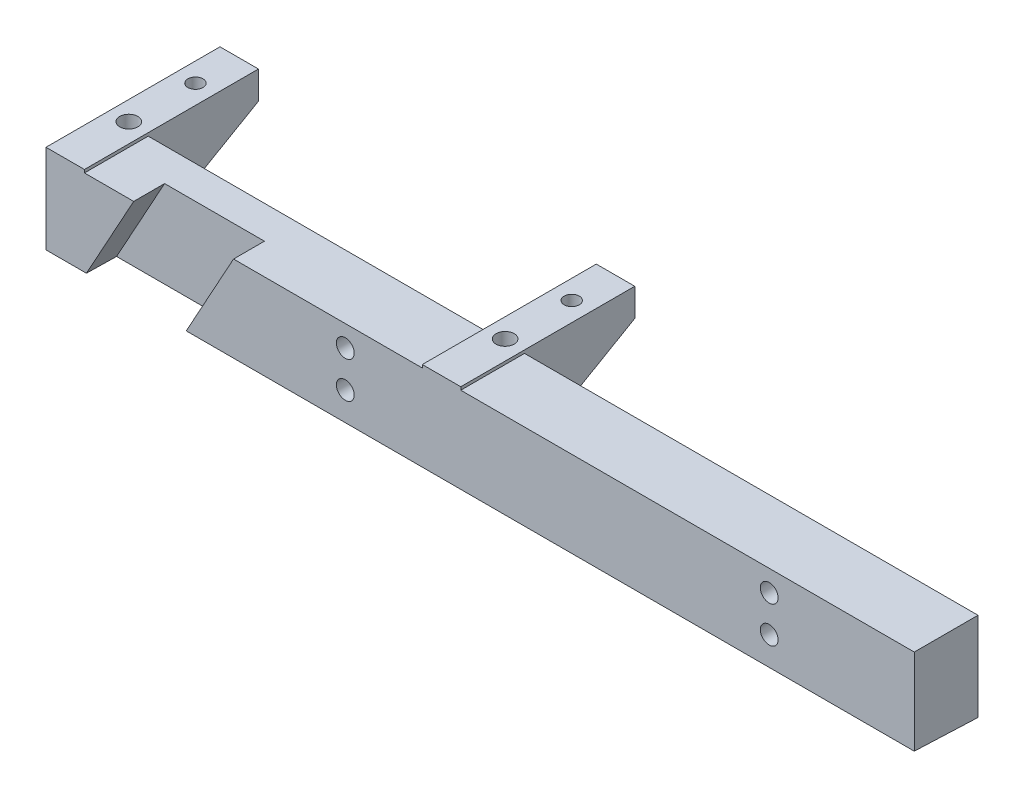
ISO-10303-21;
HEADER;
FILE_DESCRIPTION(('STEP AP214'),'2;1');
FILE_NAME('part.step','',(''),(''),'','','');
FILE_SCHEMA(('AUTOMOTIVE_DESIGN { 1 0 10303 214 1 1 1 1 }'));
ENDSEC;
DATA;
#1=APPLICATION_CONTEXT('core data for automotive mechanical design processes');
#2=APPLICATION_PROTOCOL_DEFINITION('international standard','automotive_design',2000,#1);
#3=PRODUCT_CONTEXT('',#1,'mechanical');
#4=PRODUCT('Part','Part','',(#3));
#5=PRODUCT_RELATED_PRODUCT_CATEGORY('part','',(#4));
#6=PRODUCT_DEFINITION_FORMATION('','',#4);
#7=PRODUCT_DEFINITION_CONTEXT('part definition',#1,'design');
#8=PRODUCT_DEFINITION('design','',#6,#7);
#9=PRODUCT_DEFINITION_SHAPE('','',#8);
#10=(LENGTH_UNIT() NAMED_UNIT(*) SI_UNIT(.MILLI.,.METRE.));
#11=(NAMED_UNIT(*) PLANE_ANGLE_UNIT() SI_UNIT($,.RADIAN.));
#12=(NAMED_UNIT(*) SI_UNIT($,.STERADIAN.) SOLID_ANGLE_UNIT());
#13=UNCERTAINTY_MEASURE_WITH_UNIT(LENGTH_MEASURE(1.E-05),#10,'distance_accuracy_value','');
#14=(GEOMETRIC_REPRESENTATION_CONTEXT(3) GLOBAL_UNCERTAINTY_ASSIGNED_CONTEXT((#13)) GLOBAL_UNIT_ASSIGNED_CONTEXT((#10,
#11,#12)) REPRESENTATION_CONTEXT('',''));
#15=CARTESIAN_POINT('',(0.,0.,0.));
#16=DIRECTION('',(0.,0.,1.));
#17=DIRECTION('',(1.,0.,0.));
#18=AXIS2_PLACEMENT_3D('',#15,#16,#17);
#19=CARTESIAN_POINT('',(143.3725,0.,0.));
#20=DIRECTION('',(0.,0.,-1.));
#21=DIRECTION('',(0.,1.,0.));
#22=AXIS2_PLACEMENT_3D('',#19,#20,#21);
#23=PLANE('',#22);
#24=DIRECTION('',(-1.,0.,0.));
#25=VECTOR('',#24,1.);
#26=CARTESIAN_POINT('',(143.3725,-14.18,0.));
#27=LINE('',#26,#25);
#28=CARTESIAN_POINT('',(6.67458264272988,-14.18,0.));
#29=VERTEX_POINT('',#28);
#30=CARTESIAN_POINT('',(0.,-14.18,0.));
#31=VERTEX_POINT('',#30);
#32=EDGE_CURVE('E310',#29,#31,#27,.T.);
#33=ORIENTED_EDGE('',*,*,#32,.F.);
#34=DIRECTION('',(-0.482365334124533,-0.875970139008704,0.));
#35=VECTOR('',#34,1.);
#36=CARTESIAN_POINT('',(14.483,0.,0.));
#37=LINE('',#36,#35);
#38=CARTESIAN_POINT('',(14.483,0.,0.));
#39=VERTEX_POINT('',#38);
#40=EDGE_CURVE('E191',#39,#29,#37,.T.);
#41=ORIENTED_EDGE('',*,*,#40,.F.);
#42=DIRECTION('',(-1.,0.,0.));
#43=VECTOR('',#42,1.);
#44=CARTESIAN_POINT('',(143.3725,0.,0.));
#45=LINE('',#44,#43);
#46=CARTESIAN_POINT('',(6.35000000000005,0.,0.));
#47=VERTEX_POINT('',#46);
#48=EDGE_CURVE('E317',#39,#47,#45,.T.);
#49=ORIENTED_EDGE('',*,*,#48,.T.);
#50=DIRECTION('',(0.,1.,0.));
#51=VECTOR('',#50,1.);
#52=CARTESIAN_POINT('',(6.35,0.5,0.));
#53=LINE('',#52,#51);
#54=CARTESIAN_POINT('',(6.35,0.5,0.));
#55=VERTEX_POINT('',#54);
#56=EDGE_CURVE('E271',#47,#55,#53,.T.);
#57=ORIENTED_EDGE('',*,*,#56,.T.);
#58=DIRECTION('',(-1.,0.,0.));
#59=VECTOR('',#58,1.);
#60=CARTESIAN_POINT('',(6.35,0.5,0.));
#61=LINE('',#60,#59);
#62=CARTESIAN_POINT('',(0.,0.5,0.));
#63=VERTEX_POINT('',#62);
#64=EDGE_CURVE('E287',#55,#63,#61,.T.);
#65=ORIENTED_EDGE('',*,*,#64,.T.);
#66=DIRECTION('',(0.,-1.,0.));
#67=VECTOR('',#66,1.);
#68=CARTESIAN_POINT('',(0.,0.,0.));
#69=LINE('',#68,#67);
#70=EDGE_CURVE('E304',#63,#31,#69,.T.);
#71=ORIENTED_EDGE('',*,*,#70,.T.);
#72=EDGE_LOOP('',(#33,#41,#49,#57,#65,#71));
#73=FACE_BOUND('',#72,.T.);
#74=ADVANCED_FACE('F33',(#73),#23,.F.);
#75=CARTESIAN_POINT('',(143.3725,0.,-10.525));
#76=DIRECTION('',(0.,0.,1.));
#77=DIRECTION('',(0.,-1.,0.));
#78=AXIS2_PLACEMENT_3D('',#75,#76,#77);
#79=PLANE('',#78);
#80=CARTESIAN_POINT('',(119.4195,-3.5,-10.525));
#81=DIRECTION('',(0.,0.,-1.));
#82=DIRECTION('',(0.,1.,0.));
#83=AXIS2_PLACEMENT_3D('',#80,#81,#82);
#84=CIRCLE('',#83,1.47319999999998);
#85=CARTESIAN_POINT('',(119.4195,-2.02680000000002,-10.525));
#86=VERTEX_POINT('',#85);
#87=EDGE_CURVE('E524',#86,#86,#84,.T.);
#88=ORIENTED_EDGE('',*,*,#87,.F.);
#89=EDGE_LOOP('',(#88));
#90=FACE_BOUND('',#89,.T.);
#91=CARTESIAN_POINT('',(119.4195,-9.5,-10.525));
#92=DIRECTION('',(0.,0.,-1.));
#93=DIRECTION('',(0.,1.,0.));
#94=AXIS2_PLACEMENT_3D('',#91,#92,#93);
#95=CIRCLE('',#94,1.47319999999998);
#96=CARTESIAN_POINT('',(119.4195,-8.02680000000002,-10.525));
#97=VERTEX_POINT('',#96);
#98=EDGE_CURVE('E526',#97,#97,#95,.T.);
#99=ORIENTED_EDGE('',*,*,#98,.F.);
#100=EDGE_LOOP('',(#99));
#101=FACE_BOUND('',#100,.T.);
#102=DIRECTION('',(0.,1.,0.));
#103=VECTOR('',#102,1.);
#104=CARTESIAN_POINT('',(68.4872,-14.62,-10.525));
#105=LINE('',#104,#103);
#106=CARTESIAN_POINT('',(68.4872,-14.62,-10.525));
#107=VERTEX_POINT('',#106);
#108=CARTESIAN_POINT('',(68.4872,0.,-10.525));
#109=VERTEX_POINT('',#108);
#110=EDGE_CURVE('E239',#107,#109,#105,.T.);
#111=ORIENTED_EDGE('',*,*,#110,.T.);
#112=DIRECTION('',(-1.,0.,0.));
#113=VECTOR('',#112,1.);
#114=CARTESIAN_POINT('',(143.3725,0.,-10.525));
#115=LINE('',#114,#113);
#116=CARTESIAN_POINT('',(143.3725,0.,-10.525));
#117=VERTEX_POINT('',#116);
#118=EDGE_CURVE('E323',#117,#109,#115,.T.);
#119=ORIENTED_EDGE('',*,*,#118,.F.);
#120=DIRECTION('',(0.,1.,0.));
#121=VECTOR('',#120,1.);
#122=CARTESIAN_POINT('',(143.3725,0.,-10.525));
#123=LINE('',#122,#121);
#124=CARTESIAN_POINT('',(143.3725,-14.62,-10.525));
#125=VERTEX_POINT('',#124);
#126=EDGE_CURVE('E303',#125,#117,#123,.T.);
#127=ORIENTED_EDGE('',*,*,#126,.F.);
#128=DIRECTION('',(-1.,0.,0.));
#129=VECTOR('',#128,1.);
#130=CARTESIAN_POINT('',(143.3725,-14.62,-10.525));
#131=LINE('',#130,#129);
#132=EDGE_CURVE('E41',#125,#107,#131,.T.);
#133=ORIENTED_EDGE('',*,*,#132,.T.);
#134=EDGE_LOOP('',(#111,#119,#127,#133));
#135=FACE_BOUND('',#134,.T.);
#136=ADVANCED_FACE('F387',(#90,#101,#135),#79,.F.);
#137=CARTESIAN_POINT('',(143.3725,0.,0.));
#138=DIRECTION('',(0.,-1.,0.));
#139=DIRECTION('',(0.,0.,-1.));
#140=AXIS2_PLACEMENT_3D('',#137,#138,#139);
#141=PLANE('',#140);
#142=DIRECTION('',(0.,0.,1.));
#143=VECTOR('',#142,1.);
#144=CARTESIAN_POINT('',(68.4872,0.,-10.525));
#145=LINE('',#144,#143);
#146=CARTESIAN_POINT('',(68.4872,0.,0.));
#147=VERTEX_POINT('',#146);
#148=EDGE_CURVE('E224',#109,#147,#145,.T.);
#149=ORIENTED_EDGE('',*,*,#148,.T.);
#150=CARTESIAN_POINT('',(143.3725,0.,0.));
#151=VERTEX_POINT('',#150);
#152=EDGE_CURVE('E318',#151,#147,#45,.T.);
#153=ORIENTED_EDGE('',*,*,#152,.F.);
#154=DIRECTION('',(0.,0.,1.));
#155=VECTOR('',#154,1.);
#156=CARTESIAN_POINT('',(143.3725,0.,0.));
#157=LINE('',#156,#155);
#158=EDGE_CURVE('E306',#117,#151,#157,.T.);
#159=ORIENTED_EDGE('',*,*,#158,.F.);
#160=ORIENTED_EDGE('',*,*,#118,.T.);
#161=EDGE_LOOP('',(#149,#153,#159,#160));
#162=FACE_BOUND('',#161,.T.);
#163=ADVANCED_FACE('F384',(#162),#141,.F.);
#164=CARTESIAN_POINT('',(143.3725,-14.62,-10.525));
#165=DIRECTION('',(0.,0.99912730527889,-0.0417687424534642));
#166=DIRECTION('',(0.,0.0417687424534642,0.99912730527889));
#167=AXIS2_PLACEMENT_3D('',#164,#165,#166);
#168=PLANE('',#167);
#169=DIRECTION('',(-1.,0.,0.));
#170=VECTOR('',#169,1.);
#171=CARTESIAN_POINT('',(143.3725,-14.3932066508314,-5.1));
#172=LINE('',#171,#170);
#173=CARTESIAN_POINT('',(23.0417575773217,-14.3932066508313,-5.1));
#174=VERTEX_POINT('',#173);
#175=CARTESIAN_POINT('',(6.5571773879318,-14.3932066508314,-5.1));
#176=VERTEX_POINT('',#175);
#177=EDGE_CURVE('E175',#174,#176,#172,.T.);
#178=ORIENTED_EDGE('',*,*,#177,.T.);
#179=DIRECTION('',(0.0229944666841153,0.0417576984761414,0.998863128321337));
#180=VECTOR('',#179,1.);
#181=CARTESIAN_POINT('',(6.50469694503958,-14.4885105576491,-7.37971277103928));
#182=LINE('',#181,#180);
#183=EDGE_CURVE('E196',#176,#29,#182,.T.);
#184=ORIENTED_EDGE('',*,*,#183,.T.);
#185=ORIENTED_EDGE('',*,*,#32,.T.);
#186=DIRECTION('',(0.,-0.0417687424534642,-0.99912730527889));
#187=VECTOR('',#186,1.);
#188=CARTESIAN_POINT('',(0.,-14.62,-10.525));
#189=LINE('',#188,#187);
#190=CARTESIAN_POINT('',(0.,-14.62,-10.525));
#191=VERTEX_POINT('',#190);
#192=EDGE_CURVE('E299',#31,#191,#189,.T.);
#193=ORIENTED_EDGE('',*,*,#192,.T.);
#194=DIRECTION('',(-1.,0.,0.));
#195=VECTOR('',#194,1.);
#196=CARTESIAN_POINT('',(6.35,-14.62,-10.525));
#197=LINE('',#196,#195);
#198=CARTESIAN_POINT('',(6.35000000000005,-14.62,-10.525));
#199=VERTEX_POINT('',#198);
#200=EDGE_CURVE('E290',#199,#191,#197,.T.);
#201=ORIENTED_EDGE('',*,*,#200,.F.);
#202=CARTESIAN_POINT('',(62.1372,-14.62,-10.525));
#203=VERTEX_POINT('',#202);
#204=EDGE_CURVE('E325',#203,#199,#131,.T.);
#205=ORIENTED_EDGE('',*,*,#204,.F.);
#206=DIRECTION('',(-1.,0.,0.));
#207=VECTOR('',#206,1.);
#208=CARTESIAN_POINT('',(68.4872,-14.62,-10.525));
#209=LINE('',#208,#207);
#210=EDGE_CURVE('E256',#107,#203,#209,.T.);
#211=ORIENTED_EDGE('',*,*,#210,.F.);
#212=ORIENTED_EDGE('',*,*,#132,.F.);
#213=DIRECTION('',(0.,-0.0417687424534642,-0.99912730527889));
#214=VECTOR('',#213,1.);
#215=CARTESIAN_POINT('',(143.3725,-14.62,-10.525));
#216=LINE('',#215,#214);
#217=CARTESIAN_POINT('',(143.3725,-14.18,0.));
#218=VERTEX_POINT('',#217);
#219=EDGE_CURVE('E300',#218,#125,#216,.T.);
#220=ORIENTED_EDGE('',*,*,#219,.F.);
#221=CARTESIAN_POINT('',(23.1591628321198,-14.18,0.));
#222=VERTEX_POINT('',#221);
#223=EDGE_CURVE('E314',#218,#222,#27,.T.);
#224=ORIENTED_EDGE('',*,*,#223,.T.);
#225=DIRECTION('',(-0.0229944666841153,-0.0417576984761414,-0.998863128321337));
#226=VECTOR('',#225,1.);
#227=CARTESIAN_POINT('',(22.9805609868665,-14.5043389857144,-7.7583359651008));
#228=LINE('',#227,#226);
#229=EDGE_CURVE('E48',#222,#174,#228,.T.);
#230=ORIENTED_EDGE('',*,*,#229,.T.);
#231=EDGE_LOOP('',(#178,#184,#185,#193,#201,#205,#211,#212,#220,#224,#230));
#232=FACE_BOUND('',#231,.T.);
#233=ADVANCED_FACE('F35',(#232),#168,.F.);
#234=CARTESIAN_POINT('',(49.4195,-3.5,-10.525));
#235=DIRECTION('',(0.,0.,-1.));
#236=DIRECTION('',(0.,1.,0.));
#237=AXIS2_PLACEMENT_3D('',#234,#235,#236);
#238=CIRCLE('',#237,1.47319999999999);
#239=CARTESIAN_POINT('',(49.4195,-2.02680000000001,-10.525));
#240=VERTEX_POINT('',#239);
#241=EDGE_CURVE('E407',#240,#240,#238,.T.);
#242=ORIENTED_EDGE('',*,*,#241,.F.);
#243=EDGE_LOOP('',(#242));
#244=FACE_BOUND('',#243,.T.);
#245=CARTESIAN_POINT('',(49.4195,-9.5,-10.525));
#246=DIRECTION('',(0.,0.,-1.));
#247=DIRECTION('',(0.,1.,0.));
#248=AXIS2_PLACEMENT_3D('',#245,#246,#247);
#249=CIRCLE('',#248,1.47319999999999);
#250=CARTESIAN_POINT('',(49.4195,-8.02680000000001,-10.525));
#251=VERTEX_POINT('',#250);
#252=EDGE_CURVE('E410',#251,#251,#249,.T.);
#253=ORIENTED_EDGE('',*,*,#252,.F.);
#254=EDGE_LOOP('',(#253));
#255=FACE_BOUND('',#254,.T.);
#256=CARTESIAN_POINT('',(62.1372,0.,-10.525));
#257=VERTEX_POINT('',#256);
#258=CARTESIAN_POINT('',(6.35000000000005,0.,-10.525));
#259=VERTEX_POINT('',#258);
#260=EDGE_CURVE('E321',#257,#259,#115,.T.);
#261=ORIENTED_EDGE('',*,*,#260,.F.);
#262=DIRECTION('',(0.,1.,0.));
#263=VECTOR('',#262,1.);
#264=CARTESIAN_POINT('',(62.1372,-14.62,-10.525));
#265=LINE('',#264,#263);
#266=EDGE_CURVE('E228',#203,#257,#265,.T.);
#267=ORIENTED_EDGE('',*,*,#266,.F.);
#268=ORIENTED_EDGE('',*,*,#204,.T.);
#269=DIRECTION('',(0.,1.,0.));
#270=VECTOR('',#269,1.);
#271=CARTESIAN_POINT('',(6.34999999999999,0.,-10.525));
#272=LINE('',#271,#270);
#273=EDGE_CURVE('E296',#199,#259,#272,.T.);
#274=ORIENTED_EDGE('',*,*,#273,.T.);
#275=EDGE_LOOP('',(#261,#267,#268,#274));
#276=FACE_BOUND('',#275,.T.);
#277=ADVANCED_FACE('F334',(#244,#255,#276),#79,.F.);
#278=ORIENTED_EDGE('',*,*,#48,.F.);
#279=DIRECTION('',(0.,0.,1.));
#280=VECTOR('',#279,1.);
#281=CARTESIAN_POINT('',(14.483,0.,-5.1));
#282=LINE('',#281,#280);
#283=CARTESIAN_POINT('',(14.483,0.,-5.1));
#284=VERTEX_POINT('',#283);
#285=EDGE_CURVE('E184',#284,#39,#282,.T.);
#286=ORIENTED_EDGE('',*,*,#285,.F.);
#287=DIRECTION('',(-1.,0.,0.));
#288=VECTOR('',#287,1.);
#289=CARTESIAN_POINT('',(30.9675801893899,0.,-5.1));
#290=LINE('',#289,#288);
#291=CARTESIAN_POINT('',(30.9675801893899,0.,-5.1));
#292=VERTEX_POINT('',#291);
#293=EDGE_CURVE('E172',#292,#284,#290,.T.);
#294=ORIENTED_EDGE('',*,*,#293,.F.);
#295=DIRECTION('',(0.,0.,1.));
#296=VECTOR('',#295,1.);
#297=CARTESIAN_POINT('',(30.9675801893899,0.,-5.1));
#298=LINE('',#297,#296);
#299=CARTESIAN_POINT('',(30.9675801893899,0.,0.));
#300=VERTEX_POINT('',#299);
#301=EDGE_CURVE('E179',#292,#300,#298,.T.);
#302=ORIENTED_EDGE('',*,*,#301,.T.);
#303=CARTESIAN_POINT('',(62.1372,0.,0.));
#304=VERTEX_POINT('',#303);
#305=EDGE_CURVE('E322',#304,#300,#45,.T.);
#306=ORIENTED_EDGE('',*,*,#305,.F.);
#307=DIRECTION('',(0.,0.,1.));
#308=VECTOR('',#307,1.);
#309=CARTESIAN_POINT('',(62.1372,0.,-10.525));
#310=LINE('',#309,#308);
#311=EDGE_CURVE('E55',#257,#304,#310,.T.);
#312=ORIENTED_EDGE('',*,*,#311,.F.);
#313=ORIENTED_EDGE('',*,*,#260,.T.);
#314=DIRECTION('',(0.,0.,1.));
#315=VECTOR('',#314,1.);
#316=CARTESIAN_POINT('',(6.34999999999999,0.,0.));
#317=LINE('',#316,#315);
#318=EDGE_CURVE('E286',#259,#47,#317,.T.);
#319=ORIENTED_EDGE('',*,*,#318,.T.);
#320=EDGE_LOOP('',(#278,#286,#294,#302,#306,#312,#313,#319));
#321=FACE_BOUND('',#320,.T.);
#322=ADVANCED_FACE('F187',(#321),#141,.F.);
#323=CARTESIAN_POINT('',(119.4195,-3.49999999999998,0.));
#324=DIRECTION('',(0.,0.,-1.));
#325=DIRECTION('',(0.,1.,0.));
#326=AXIS2_PLACEMENT_3D('',#323,#324,#325);
#327=CIRCLE('',#326,1.47319999999998);
#328=CARTESIAN_POINT('',(119.4195,-2.0268,0.));
#329=VERTEX_POINT('',#328);
#330=EDGE_CURVE('E495',#329,#329,#327,.T.);
#331=ORIENTED_EDGE('',*,*,#330,.T.);
#332=EDGE_LOOP('',(#331));
#333=FACE_BOUND('',#332,.T.);
#334=CARTESIAN_POINT('',(119.4195,-9.49999999999998,0.));
#335=DIRECTION('',(0.,0.,-1.));
#336=DIRECTION('',(0.,1.,0.));
#337=AXIS2_PLACEMENT_3D('',#334,#335,#336);
#338=CIRCLE('',#337,1.47319999999998);
#339=CARTESIAN_POINT('',(119.4195,-8.0268,0.));
#340=VERTEX_POINT('',#339);
#341=EDGE_CURVE('E499',#340,#340,#338,.T.);
#342=ORIENTED_EDGE('',*,*,#341,.T.);
#343=EDGE_LOOP('',(#342));
#344=FACE_BOUND('',#343,.T.);
#345=CARTESIAN_POINT('',(49.4195,-3.49999999999998,0.));
#346=DIRECTION('',(0.,0.,-1.));
#347=DIRECTION('',(0.,1.,0.));
#348=AXIS2_PLACEMENT_3D('',#345,#346,#347);
#349=CIRCLE('',#348,1.47319999999999);
#350=CARTESIAN_POINT('',(49.4195,-2.02679999999999,0.));
#351=VERTEX_POINT('',#350);
#352=EDGE_CURVE('E412',#351,#351,#349,.T.);
#353=ORIENTED_EDGE('',*,*,#352,.T.);
#354=EDGE_LOOP('',(#353));
#355=FACE_BOUND('',#354,.T.);
#356=CARTESIAN_POINT('',(49.4195,-9.49999999999998,0.));
#357=DIRECTION('',(0.,0.,-1.));
#358=DIRECTION('',(0.,1.,0.));
#359=AXIS2_PLACEMENT_3D('',#356,#357,#358);
#360=CIRCLE('',#359,1.47319999999999);
#361=CARTESIAN_POINT('',(49.4195,-8.02679999999999,0.));
#362=VERTEX_POINT('',#361);
#363=EDGE_CURVE('E193',#362,#362,#360,.T.);
#364=ORIENTED_EDGE('',*,*,#363,.T.);
#365=EDGE_LOOP('',(#364));
#366=FACE_BOUND('',#365,.T.);
#367=ORIENTED_EDGE('',*,*,#305,.T.);
#368=DIRECTION('',(-0.482365334124533,-0.875970139008704,0.));
#369=VECTOR('',#368,1.);
#370=CARTESIAN_POINT('',(57.1215427823101,47.495308280661,0.));
#371=LINE('',#370,#369);
#372=EDGE_CURVE('E11',#300,#222,#371,.T.);
#373=ORIENTED_EDGE('',*,*,#372,.T.);
#374=ORIENTED_EDGE('',*,*,#223,.F.);
#375=DIRECTION('',(0.,-1.,0.));
#376=VECTOR('',#375,1.);
#377=CARTESIAN_POINT('',(143.3725,0.,0.));
#378=LINE('',#377,#376);
#379=EDGE_CURVE('E308',#151,#218,#378,.T.);
#380=ORIENTED_EDGE('',*,*,#379,.F.);
#381=ORIENTED_EDGE('',*,*,#152,.T.);
#382=DIRECTION('',(0.,1.,0.));
#383=VECTOR('',#382,1.);
#384=CARTESIAN_POINT('',(68.4872,0.,0.));
#385=LINE('',#384,#383);
#386=CARTESIAN_POINT('',(68.4872,0.5,0.));
#387=VERTEX_POINT('',#386);
#388=EDGE_CURVE('E227',#147,#387,#385,.T.);
#389=ORIENTED_EDGE('',*,*,#388,.T.);
#390=DIRECTION('',(-1.,0.,0.));
#391=VECTOR('',#390,1.);
#392=CARTESIAN_POINT('',(68.4872,0.5,0.));
#393=LINE('',#392,#391);
#394=CARTESIAN_POINT('',(62.1372,0.5,0.));
#395=VERTEX_POINT('',#394);
#396=EDGE_CURVE('E242',#387,#395,#393,.T.);
#397=ORIENTED_EDGE('',*,*,#396,.T.);
#398=DIRECTION('',(0.,1.,0.));
#399=VECTOR('',#398,1.);
#400=CARTESIAN_POINT('',(62.1372,0.,0.));
#401=LINE('',#400,#399);
#402=EDGE_CURVE('E244',#304,#395,#401,.T.);
#403=ORIENTED_EDGE('',*,*,#402,.F.);
#404=EDGE_LOOP('',(#367,#373,#374,#380,#381,#389,#397,#403));
#405=FACE_BOUND('',#404,.T.);
#406=ADVANCED_FACE('F360',(#333,#344,#355,#366,#405),#23,.F.);
#407=CARTESIAN_POINT('',(143.3725,-14.62,-10.525));
#408=DIRECTION('',(1.,0.,0.));
#409=DIRECTION('',(0.,0.,-1.));
#410=AXIS2_PLACEMENT_3D('',#407,#408,#409);
#411=PLANE('',#410);
#412=ORIENTED_EDGE('',*,*,#219,.T.);
#413=ORIENTED_EDGE('',*,*,#126,.T.);
#414=ORIENTED_EDGE('',*,*,#158,.T.);
#415=ORIENTED_EDGE('',*,*,#379,.T.);
#416=EDGE_LOOP('',(#412,#413,#414,#415));
#417=FACE_BOUND('',#416,.T.);
#418=ADVANCED_FACE('F378',(#417),#411,.T.);
#419=CARTESIAN_POINT('',(0.,-14.62,-10.525));
#420=DIRECTION('',(1.,0.,0.));
#421=DIRECTION('',(0.,0.,-1.));
#422=AXIS2_PLACEMENT_3D('',#419,#420,#421);
#423=PLANE('',#422);
#424=ORIENTED_EDGE('',*,*,#192,.F.);
#425=ORIENTED_EDGE('',*,*,#70,.F.);
#426=DIRECTION('',(0.,0.,-1.));
#427=VECTOR('',#426,1.);
#428=CARTESIAN_POINT('',(0.,0.5,-28.732));
#429=LINE('',#428,#427);
#430=CARTESIAN_POINT('',(0.,0.5,-28.732));
#431=VERTEX_POINT('',#430);
#432=EDGE_CURVE('E268',#63,#431,#429,.T.);
#433=ORIENTED_EDGE('',*,*,#432,.T.);
#434=DIRECTION('',(0.,-1.,0.));
#435=VECTOR('',#434,1.);
#436=CARTESIAN_POINT('',(0.,-4.10818364886437,-28.732));
#437=LINE('',#436,#435);
#438=CARTESIAN_POINT('',(0.,-4.10818364886437,-28.732));
#439=VERTEX_POINT('',#438);
#440=EDGE_CURVE('E258',#431,#439,#437,.T.);
#441=ORIENTED_EDGE('',*,*,#440,.T.);
#442=DIRECTION('',(0.,-0.500000000000004,0.866025403784436));
#443=VECTOR('',#442,1.);
#444=CARTESIAN_POINT('',(0.,-4.10818364886437,-28.732));
#445=LINE('',#444,#443);
#446=EDGE_CURVE('E279',#439,#191,#445,.T.);
#447=ORIENTED_EDGE('',*,*,#446,.T.);
#448=EDGE_LOOP('',(#424,#425,#433,#441,#447));
#449=FACE_BOUND('',#448,.T.);
#450=ADVANCED_FACE('F476',(#449),#423,.F.);
#451=CARTESIAN_POINT('',(6.35,0.5,-28.732));
#452=DIRECTION('',(1.,0.,0.));
#453=DIRECTION('',(0.,0.,-1.));
#454=AXIS2_PLACEMENT_3D('',#451,#452,#453);
#455=PLANE('',#454);
#456=ORIENTED_EDGE('',*,*,#273,.F.);
#457=DIRECTION('',(0.,-0.500000000000004,0.866025403784436));
#458=VECTOR('',#457,1.);
#459=CARTESIAN_POINT('',(6.35,-4.10818364886437,-28.732));
#460=LINE('',#459,#458);
#461=CARTESIAN_POINT('',(6.35,-4.10818364886437,-28.732));
#462=VERTEX_POINT('',#461);
#463=EDGE_CURVE('E267',#462,#199,#460,.T.);
#464=ORIENTED_EDGE('',*,*,#463,.F.);
#465=DIRECTION('',(0.,-1.,0.));
#466=VECTOR('',#465,1.);
#467=CARTESIAN_POINT('',(6.35,-4.10818364886437,-28.732));
#468=LINE('',#467,#466);
#469=CARTESIAN_POINT('',(6.35,0.5,-28.732));
#470=VERTEX_POINT('',#469);
#471=EDGE_CURVE('E264',#470,#462,#468,.T.);
#472=ORIENTED_EDGE('',*,*,#471,.F.);
#473=DIRECTION('',(0.,0.,-1.));
#474=VECTOR('',#473,1.);
#475=CARTESIAN_POINT('',(6.35,0.5,-28.732));
#476=LINE('',#475,#474);
#477=EDGE_CURVE('E273',#55,#470,#476,.T.);
#478=ORIENTED_EDGE('',*,*,#477,.F.);
#479=ORIENTED_EDGE('',*,*,#56,.F.);
#480=ORIENTED_EDGE('',*,*,#318,.F.);
#481=EDGE_LOOP('',(#456,#464,#472,#478,#479,#480));
#482=FACE_BOUND('',#481,.T.);
#483=ADVANCED_FACE('F344',(#482),#455,.T.);
#484=CARTESIAN_POINT('',(6.35,-4.10818364886437,-28.732));
#485=DIRECTION('',(0.,0.,-1.));
#486=DIRECTION('',(-1.,0.,0.));
#487=AXIS2_PLACEMENT_3D('',#484,#485,#486);
#488=PLANE('',#487);
#489=ORIENTED_EDGE('',*,*,#440,.F.);
#490=DIRECTION('',(-1.,0.,0.));
#491=VECTOR('',#490,1.);
#492=CARTESIAN_POINT('',(6.35,0.5,-28.732));
#493=LINE('',#492,#491);
#494=EDGE_CURVE('E284',#470,#431,#493,.T.);
#495=ORIENTED_EDGE('',*,*,#494,.F.);
#496=ORIENTED_EDGE('',*,*,#471,.T.);
#497=DIRECTION('',(-1.,0.,0.));
#498=VECTOR('',#497,1.);
#499=CARTESIAN_POINT('',(6.35,-4.10818364886437,-28.732));
#500=LINE('',#499,#498);
#501=EDGE_CURVE('E276',#462,#439,#500,.T.);
#502=ORIENTED_EDGE('',*,*,#501,.T.);
#503=EDGE_LOOP('',(#489,#495,#496,#502));
#504=FACE_BOUND('',#503,.T.);
#505=ADVANCED_FACE('F350',(#504),#488,.T.);
#506=CARTESIAN_POINT('',(6.35,0.5,-28.732));
#507=DIRECTION('',(0.,1.,0.));
#508=DIRECTION('',(0.,0.,1.));
#509=AXIS2_PLACEMENT_3D('',#506,#507,#508);
#510=PLANE('',#509);
#511=CARTESIAN_POINT('',(3.175,0.5,-21.5));
#512=DIRECTION('',(0.,1.,0.));
#513=DIRECTION('',(0.,0.,1.));
#514=AXIS2_PLACEMENT_3D('',#511,#512,#513);
#515=CIRCLE('',#514,1.25);
#516=CARTESIAN_POINT('',(3.175,0.5,-20.25));
#517=VERTEX_POINT('',#516);
#518=EDGE_CURVE('E200',#517,#517,#515,.T.);
#519=ORIENTED_EDGE('',*,*,#518,.F.);
#520=EDGE_LOOP('',(#519));
#521=FACE_BOUND('',#520,.T.);
#522=CARTESIAN_POINT('',(3.175,0.5,-10.5));
#523=DIRECTION('',(0.,1.,0.));
#524=DIRECTION('',(0.,0.,1.));
#525=AXIS2_PLACEMENT_3D('',#522,#523,#524);
#526=CIRCLE('',#525,1.5);
#527=CARTESIAN_POINT('',(3.175,0.5,-9.));
#528=VERTEX_POINT('',#527);
#529=EDGE_CURVE('E218',#528,#528,#526,.T.);
#530=ORIENTED_EDGE('',*,*,#529,.F.);
#531=EDGE_LOOP('',(#530));
#532=FACE_BOUND('',#531,.T.);
#533=ORIENTED_EDGE('',*,*,#432,.F.);
#534=ORIENTED_EDGE('',*,*,#64,.F.);
#535=ORIENTED_EDGE('',*,*,#477,.T.);
#536=ORIENTED_EDGE('',*,*,#494,.T.);
#537=EDGE_LOOP('',(#533,#534,#535,#536));
#538=FACE_BOUND('',#537,.T.);
#539=ADVANCED_FACE('F355',(#521,#532,#538),#510,.T.);
#540=CARTESIAN_POINT('',(6.35,-4.10818364886437,-28.732));
#541=DIRECTION('',(0.,-0.866025403784436,-0.500000000000004));
#542=DIRECTION('',(0.,0.500000000000004,-0.866025403784436));
#543=AXIS2_PLACEMENT_3D('',#540,#541,#542);
#544=PLANE('',#543);
#545=ORIENTED_EDGE('',*,*,#446,.F.);
#546=ORIENTED_EDGE('',*,*,#501,.F.);
#547=ORIENTED_EDGE('',*,*,#463,.T.);
#548=ORIENTED_EDGE('',*,*,#200,.T.);
#549=EDGE_LOOP('',(#545,#546,#547,#548));
#550=FACE_BOUND('',#549,.T.);
#551=ADVANCED_FACE('F347',(#550),#544,.T.);
#552=CARTESIAN_POINT('',(68.4872,-4.10818364886437,-28.732));
#553=DIRECTION('',(0.,-0.866025403784436,-0.500000000000004));
#554=DIRECTION('',(0.,0.500000000000004,-0.866025403784436));
#555=AXIS2_PLACEMENT_3D('',#552,#553,#554);
#556=PLANE('',#555);
#557=DIRECTION('',(0.,-0.500000000000004,0.866025403784436));
#558=VECTOR('',#557,1.);
#559=CARTESIAN_POINT('',(62.1372,-4.10818364886437,-28.732));
#560=LINE('',#559,#558);
#561=CARTESIAN_POINT('',(62.1372,-4.10818364886437,-28.732));
#562=VERTEX_POINT('',#561);
#563=EDGE_CURVE('E252',#562,#203,#560,.T.);
#564=ORIENTED_EDGE('',*,*,#563,.F.);
#565=DIRECTION('',(-1.,0.,0.));
#566=VECTOR('',#565,1.);
#567=CARTESIAN_POINT('',(68.4872,-4.10818364886437,-28.732));
#568=LINE('',#567,#566);
#569=CARTESIAN_POINT('',(68.4872,-4.10818364886437,-28.732));
#570=VERTEX_POINT('',#569);
#571=EDGE_CURVE('E259',#570,#562,#568,.T.);
#572=ORIENTED_EDGE('',*,*,#571,.F.);
#573=DIRECTION('',(0.,-0.500000000000004,0.866025403784436));
#574=VECTOR('',#573,1.);
#575=CARTESIAN_POINT('',(68.4872,-4.10818364886437,-28.732));
#576=LINE('',#575,#574);
#577=EDGE_CURVE('E237',#570,#107,#576,.T.);
#578=ORIENTED_EDGE('',*,*,#577,.T.);
#579=ORIENTED_EDGE('',*,*,#210,.T.);
#580=EDGE_LOOP('',(#564,#572,#578,#579));
#581=FACE_BOUND('',#580,.T.);
#582=ADVANCED_FACE('F374',(#581),#556,.T.);
#583=CARTESIAN_POINT('',(68.4872,0.5,-28.732));
#584=DIRECTION('',(0.,0.,-1.));
#585=DIRECTION('',(-1.,0.,0.));
#586=AXIS2_PLACEMENT_3D('',#583,#584,#585);
#587=PLANE('',#586);
#588=DIRECTION('',(0.,-1.,0.));
#589=VECTOR('',#588,1.);
#590=CARTESIAN_POINT('',(62.1372,0.5,-28.732));
#591=LINE('',#590,#589);
#592=CARTESIAN_POINT('',(62.1372,0.5,-28.732));
#593=VERTEX_POINT('',#592);
#594=EDGE_CURVE('E249',#593,#562,#591,.T.);
#595=ORIENTED_EDGE('',*,*,#594,.F.);
#596=DIRECTION('',(-1.,0.,0.));
#597=VECTOR('',#596,1.);
#598=CARTESIAN_POINT('',(68.4872,0.5,-28.732));
#599=LINE('',#598,#597);
#600=CARTESIAN_POINT('',(68.4872,0.5,-28.732));
#601=VERTEX_POINT('',#600);
#602=EDGE_CURVE('E261',#601,#593,#599,.T.);
#603=ORIENTED_EDGE('',*,*,#602,.F.);
#604=DIRECTION('',(0.,-1.,0.));
#605=VECTOR('',#604,1.);
#606=CARTESIAN_POINT('',(68.4872,0.5,-28.732));
#607=LINE('',#606,#605);
#608=EDGE_CURVE('E234',#601,#570,#607,.T.);
#609=ORIENTED_EDGE('',*,*,#608,.T.);
#610=ORIENTED_EDGE('',*,*,#571,.T.);
#611=EDGE_LOOP('',(#595,#603,#609,#610));
#612=FACE_BOUND('',#611,.T.);
#613=ADVANCED_FACE('F370',(#612),#587,.T.);
#614=CARTESIAN_POINT('',(68.4872,0.5,0.));
#615=DIRECTION('',(0.,1.,0.));
#616=DIRECTION('',(0.,0.,1.));
#617=AXIS2_PLACEMENT_3D('',#614,#615,#616);
#618=PLANE('',#617);
#619=CARTESIAN_POINT('',(65.3122,0.5,-21.5));
#620=DIRECTION('',(0.,1.,0.));
#621=DIRECTION('',(0.,0.,1.));
#622=AXIS2_PLACEMENT_3D('',#619,#620,#621);
#623=CIRCLE('',#622,1.25);
#624=CARTESIAN_POINT('',(65.3122,0.5,-20.25));
#625=VERTEX_POINT('',#624);
#626=EDGE_CURVE('E206',#625,#625,#623,.T.);
#627=ORIENTED_EDGE('',*,*,#626,.F.);
#628=EDGE_LOOP('',(#627));
#629=FACE_BOUND('',#628,.T.);
#630=CARTESIAN_POINT('',(65.3122,0.5,-10.5));
#631=DIRECTION('',(0.,1.,0.));
#632=DIRECTION('',(0.,0.,1.));
#633=AXIS2_PLACEMENT_3D('',#630,#631,#632);
#634=CIRCLE('',#633,1.5);
#635=CARTESIAN_POINT('',(65.3122,0.5,-9.));
#636=VERTEX_POINT('',#635);
#637=EDGE_CURVE('E212',#636,#636,#634,.T.);
#638=ORIENTED_EDGE('',*,*,#637,.F.);
#639=EDGE_LOOP('',(#638));
#640=FACE_BOUND('',#639,.T.);
#641=DIRECTION('',(0.,0.,-1.));
#642=VECTOR('',#641,1.);
#643=CARTESIAN_POINT('',(62.1372,0.5,0.));
#644=LINE('',#643,#642);
#645=EDGE_CURVE('E246',#395,#593,#644,.T.);
#646=ORIENTED_EDGE('',*,*,#645,.F.);
#647=ORIENTED_EDGE('',*,*,#396,.F.);
#648=DIRECTION('',(0.,0.,-1.));
#649=VECTOR('',#648,1.);
#650=CARTESIAN_POINT('',(68.4872,0.5,0.));
#651=LINE('',#650,#649);
#652=EDGE_CURVE('E231',#387,#601,#651,.T.);
#653=ORIENTED_EDGE('',*,*,#652,.T.);
#654=ORIENTED_EDGE('',*,*,#602,.T.);
#655=EDGE_LOOP('',(#646,#647,#653,#654));
#656=FACE_BOUND('',#655,.T.);
#657=ADVANCED_FACE('F366',(#629,#640,#656),#618,.T.);
#658=CARTESIAN_POINT('',(68.4872,0.,0.));
#659=DIRECTION('',(-1.,0.,0.));
#660=DIRECTION('',(0.,0.,1.));
#661=AXIS2_PLACEMENT_3D('',#658,#659,#660);
#662=PLANE('',#661);
#663=ORIENTED_EDGE('',*,*,#148,.F.);
#664=ORIENTED_EDGE('',*,*,#110,.F.);
#665=ORIENTED_EDGE('',*,*,#577,.F.);
#666=ORIENTED_EDGE('',*,*,#608,.F.);
#667=ORIENTED_EDGE('',*,*,#652,.F.);
#668=ORIENTED_EDGE('',*,*,#388,.F.);
#669=EDGE_LOOP('',(#663,#664,#665,#666,#667,#668));
#670=FACE_BOUND('',#669,.T.);
#671=ADVANCED_FACE('F386',(#670),#662,.F.);
#672=CARTESIAN_POINT('',(62.1372,0.,0.));
#673=DIRECTION('',(-1.,0.,0.));
#674=DIRECTION('',(0.,0.,1.));
#675=AXIS2_PLACEMENT_3D('',#672,#673,#674);
#676=PLANE('',#675);
#677=ORIENTED_EDGE('',*,*,#311,.T.);
#678=ORIENTED_EDGE('',*,*,#402,.T.);
#679=ORIENTED_EDGE('',*,*,#645,.T.);
#680=ORIENTED_EDGE('',*,*,#594,.T.);
#681=ORIENTED_EDGE('',*,*,#563,.T.);
#682=ORIENTED_EDGE('',*,*,#266,.T.);
#683=EDGE_LOOP('',(#677,#678,#679,#680,#681,#682));
#684=FACE_BOUND('',#683,.T.);
#685=ADVANCED_FACE('F363',(#684),#676,.T.);
#686=CARTESIAN_POINT('',(3.175,-7.,-10.5));
#687=DIRECTION('',(0.,1.,0.));
#688=DIRECTION('',(0.,0.,1.));
#689=AXIS2_PLACEMENT_3D('',#686,#687,#688);
#690=CONICAL_SURFACE('',#689,1.5,1.02974425867665);
#691=CARTESIAN_POINT('',(3.17499999999999,-7.90129092854134,-10.5));
#692=VERTEX_POINT('',#691);
#693=VERTEX_LOOP('',#692);
#694=FACE_BOUND('',#693,.T.);
#695=CARTESIAN_POINT('',(3.175,-7.,-10.5));
#696=DIRECTION('',(0.,1.,0.));
#697=DIRECTION('',(0.,0.,1.));
#698=AXIS2_PLACEMENT_3D('',#695,#696,#697);
#699=CIRCLE('',#698,1.5);
#700=CARTESIAN_POINT('',(3.175,-7.,-9.));
#701=VERTEX_POINT('',#700);
#702=EDGE_CURVE('E221',#701,#701,#699,.T.);
#703=ORIENTED_EDGE('',*,*,#702,.T.);
#704=EDGE_LOOP('',(#703));
#705=FACE_BOUND('',#704,.T.);
#706=ADVANCED_FACE('F458',(#694,#705),#690,.F.);
#707=CARTESIAN_POINT('',(3.175,0.5,-10.5));
#708=DIRECTION('',(0.,1.,0.));
#709=DIRECTION('',(0.,0.,1.));
#710=AXIS2_PLACEMENT_3D('',#707,#708,#709);
#711=CYLINDRICAL_SURFACE('',#710,1.5);
#712=ORIENTED_EDGE('',*,*,#702,.F.);
#713=EDGE_LOOP('',(#712));
#714=FACE_BOUND('',#713,.T.);
#715=ORIENTED_EDGE('',*,*,#529,.T.);
#716=EDGE_LOOP('',(#715));
#717=FACE_BOUND('',#716,.T.);
#718=ADVANCED_FACE('F454',(#714,#717),#711,.F.);
#719=CARTESIAN_POINT('',(65.3122,-7.,-10.5));
#720=DIRECTION('',(0.,1.,0.));
#721=DIRECTION('',(0.,0.,1.));
#722=AXIS2_PLACEMENT_3D('',#719,#720,#721);
#723=CONICAL_SURFACE('',#722,1.5,1.02974425867666);
#724=CARTESIAN_POINT('',(65.3122,-7.90129092854134,-10.5));
#725=VERTEX_POINT('',#724);
#726=VERTEX_LOOP('',#725);
#727=FACE_BOUND('',#726,.T.);
#728=CARTESIAN_POINT('',(65.3122,-7.,-10.5));
#729=DIRECTION('',(0.,1.,0.));
#730=DIRECTION('',(0.,0.,1.));
#731=AXIS2_PLACEMENT_3D('',#728,#729,#730);
#732=CIRCLE('',#731,1.5);
#733=CARTESIAN_POINT('',(65.3122,-7.,-9.));
#734=VERTEX_POINT('',#733);
#735=EDGE_CURVE('E215',#734,#734,#732,.T.);
#736=ORIENTED_EDGE('',*,*,#735,.T.);
#737=EDGE_LOOP('',(#736));
#738=FACE_BOUND('',#737,.T.);
#739=ADVANCED_FACE('F450',(#727,#738),#723,.F.);
#740=CARTESIAN_POINT('',(65.3122,0.5,-10.5));
#741=DIRECTION('',(0.,1.,0.));
#742=DIRECTION('',(0.,0.,1.));
#743=AXIS2_PLACEMENT_3D('',#740,#741,#742);
#744=CYLINDRICAL_SURFACE('',#743,1.5);
#745=ORIENTED_EDGE('',*,*,#735,.F.);
#746=EDGE_LOOP('',(#745));
#747=FACE_BOUND('',#746,.T.);
#748=ORIENTED_EDGE('',*,*,#637,.T.);
#749=EDGE_LOOP('',(#748));
#750=FACE_BOUND('',#749,.T.);
#751=ADVANCED_FACE('F446',(#747,#750),#744,.F.);
#752=CARTESIAN_POINT('',(65.3122,-5.85,-21.5));
#753=DIRECTION('',(0.,1.,0.));
#754=DIRECTION('',(0.,0.,1.));
#755=AXIS2_PLACEMENT_3D('',#752,#753,#754);
#756=CONICAL_SURFACE('',#755,1.25,1.02974425867666);
#757=CARTESIAN_POINT('',(65.3122,-6.60107577378445,-21.5));
#758=VERTEX_POINT('',#757);
#759=VERTEX_LOOP('',#758);
#760=FACE_BOUND('',#759,.T.);
#761=CARTESIAN_POINT('',(65.3122,-5.85,-21.5));
#762=DIRECTION('',(0.,1.,0.));
#763=DIRECTION('',(0.,0.,1.));
#764=AXIS2_PLACEMENT_3D('',#761,#762,#763);
#765=CIRCLE('',#764,1.25);
#766=CARTESIAN_POINT('',(65.3122,-5.85,-20.25));
#767=VERTEX_POINT('',#766);
#768=EDGE_CURVE('E209',#767,#767,#765,.T.);
#769=ORIENTED_EDGE('',*,*,#768,.T.);
#770=EDGE_LOOP('',(#769));
#771=FACE_BOUND('',#770,.T.);
#772=ADVANCED_FACE('F442',(#760,#771),#756,.F.);
#773=CARTESIAN_POINT('',(65.3122,0.5,-21.5));
#774=DIRECTION('',(0.,1.,0.));
#775=DIRECTION('',(0.,0.,1.));
#776=AXIS2_PLACEMENT_3D('',#773,#774,#775);
#777=CYLINDRICAL_SURFACE('',#776,1.25);
#778=ORIENTED_EDGE('',*,*,#768,.F.);
#779=EDGE_LOOP('',(#778));
#780=FACE_BOUND('',#779,.T.);
#781=ORIENTED_EDGE('',*,*,#626,.T.);
#782=EDGE_LOOP('',(#781));
#783=FACE_BOUND('',#782,.T.);
#784=ADVANCED_FACE('F438',(#780,#783),#777,.F.);
#785=CARTESIAN_POINT('',(3.175,-5.85,-21.5));
#786=DIRECTION('',(0.,1.,0.));
#787=DIRECTION('',(0.,0.,1.));
#788=AXIS2_PLACEMENT_3D('',#785,#786,#787);
#789=CONICAL_SURFACE('',#788,1.25,1.02974425867665);
#790=CARTESIAN_POINT('',(3.17499999999999,-6.60107577378445,-21.5));
#791=VERTEX_POINT('',#790);
#792=VERTEX_LOOP('',#791);
#793=FACE_BOUND('',#792,.T.);
#794=CARTESIAN_POINT('',(3.175,-5.85,-21.5));
#795=DIRECTION('',(0.,1.,0.));
#796=DIRECTION('',(0.,0.,1.));
#797=AXIS2_PLACEMENT_3D('',#794,#795,#796);
#798=CIRCLE('',#797,1.25);
#799=CARTESIAN_POINT('',(3.175,-5.85,-20.25));
#800=VERTEX_POINT('',#799);
#801=EDGE_CURVE('E203',#800,#800,#798,.T.);
#802=ORIENTED_EDGE('',*,*,#801,.T.);
#803=EDGE_LOOP('',(#802));
#804=FACE_BOUND('',#803,.T.);
#805=ADVANCED_FACE('F434',(#793,#804),#789,.F.);
#806=CARTESIAN_POINT('',(3.175,0.5,-21.5));
#807=DIRECTION('',(0.,1.,0.));
#808=DIRECTION('',(0.,0.,1.));
#809=AXIS2_PLACEMENT_3D('',#806,#807,#808);
#810=CYLINDRICAL_SURFACE('',#809,1.25);
#811=ORIENTED_EDGE('',*,*,#801,.F.);
#812=EDGE_LOOP('',(#811));
#813=FACE_BOUND('',#812,.T.);
#814=ORIENTED_EDGE('',*,*,#518,.T.);
#815=EDGE_LOOP('',(#814));
#816=FACE_BOUND('',#815,.T.);
#817=ADVANCED_FACE('F429',(#813,#816),#810,.F.);
#818=CARTESIAN_POINT('',(6.43229042572009,-14.62,-5.1));
#819=DIRECTION('',(0.,0.,-1.));
#820=DIRECTION('',(-1.,0.,0.));
#821=AXIS2_PLACEMENT_3D('',#818,#819,#820);
#822=PLANE('',#821);
#823=DIRECTION('',(0.482365334124533,0.875970139008704,0.));
#824=VECTOR('',#823,1.);
#825=CARTESIAN_POINT('',(30.9675801893899,0.,-5.1));
#826=LINE('',#825,#824);
#827=EDGE_CURVE('E167',#174,#292,#826,.T.);
#828=ORIENTED_EDGE('',*,*,#827,.T.);
#829=ORIENTED_EDGE('',*,*,#293,.T.);
#830=DIRECTION('',(-0.482365334124533,-0.875970139008704,0.));
#831=VECTOR('',#830,1.);
#832=CARTESIAN_POINT('',(14.483,0.,-5.1));
#833=LINE('',#832,#831);
#834=EDGE_CURVE('E176',#284,#176,#833,.T.);
#835=ORIENTED_EDGE('',*,*,#834,.T.);
#836=ORIENTED_EDGE('',*,*,#177,.F.);
#837=EDGE_LOOP('',(#828,#829,#835,#836));
#838=FACE_BOUND('',#837,.T.);
#839=ADVANCED_FACE('F169',(#838),#822,.F.);
#840=CARTESIAN_POINT('',(14.483,0.,-5.1));
#841=DIRECTION('',(-0.875970139008704,0.482365334124533,0.));
#842=DIRECTION('',(-0.482365334124533,-0.875970139008704,0.));
#843=AXIS2_PLACEMENT_3D('',#840,#841,#842);
#844=PLANE('',#843);
#845=ORIENTED_EDGE('',*,*,#834,.F.);
#846=ORIENTED_EDGE('',*,*,#285,.T.);
#847=ORIENTED_EDGE('',*,*,#40,.T.);
#848=ORIENTED_EDGE('',*,*,#183,.F.);
#849=EDGE_LOOP('',(#845,#846,#847,#848));
#850=FACE_BOUND('',#849,.T.);
#851=ADVANCED_FACE('F420',(#850),#844,.F.);
#852=CARTESIAN_POINT('',(30.9675801893899,0.,-5.1));
#853=DIRECTION('',(0.875970139008704,-0.482365334124533,0.));
#854=DIRECTION('',(0.482365334124533,0.875970139008704,0.));
#855=AXIS2_PLACEMENT_3D('',#852,#853,#854);
#856=PLANE('',#855);
#857=ORIENTED_EDGE('',*,*,#372,.F.);
#858=ORIENTED_EDGE('',*,*,#301,.F.);
#859=ORIENTED_EDGE('',*,*,#827,.F.);
#860=ORIENTED_EDGE('',*,*,#229,.F.);
#861=EDGE_LOOP('',(#857,#858,#859,#860));
#862=FACE_BOUND('',#861,.T.);
#863=ADVANCED_FACE('F180',(#862),#856,.F.);
#864=CARTESIAN_POINT('',(49.4195,-9.5,-10.525));
#865=DIRECTION('',(0.,0.,-1.));
#866=DIRECTION('',(0.,1.,0.));
#867=AXIS2_PLACEMENT_3D('',#864,#865,#866);
#868=CYLINDRICAL_SURFACE('',#867,1.47319999999999);
#869=ORIENTED_EDGE('',*,*,#363,.F.);
#870=EDGE_LOOP('',(#869));
#871=FACE_BOUND('',#870,.T.);
#872=ORIENTED_EDGE('',*,*,#252,.T.);
#873=EDGE_LOOP('',(#872));
#874=FACE_BOUND('',#873,.T.);
#875=ADVANCED_FACE('F427',(#871,#874),#868,.F.);
#876=CARTESIAN_POINT('',(49.4195,-3.5,-10.525));
#877=DIRECTION('',(0.,0.,-1.));
#878=DIRECTION('',(0.,1.,0.));
#879=AXIS2_PLACEMENT_3D('',#876,#877,#878);
#880=CYLINDRICAL_SURFACE('',#879,1.47319999999999);
#881=ORIENTED_EDGE('',*,*,#352,.F.);
#882=EDGE_LOOP('',(#881));
#883=FACE_BOUND('',#882,.T.);
#884=ORIENTED_EDGE('',*,*,#241,.T.);
#885=EDGE_LOOP('',(#884));
#886=FACE_BOUND('',#885,.T.);
#887=ADVANCED_FACE('F505',(#883,#886),#880,.F.);
#888=CARTESIAN_POINT('',(119.4195,-9.5,-10.525));
#889=DIRECTION('',(0.,0.,-1.));
#890=DIRECTION('',(0.,1.,0.));
#891=AXIS2_PLACEMENT_3D('',#888,#889,#890);
#892=CYLINDRICAL_SURFACE('',#891,1.47319999999998);
#893=ORIENTED_EDGE('',*,*,#341,.F.);
#894=EDGE_LOOP('',(#893));
#895=FACE_BOUND('',#894,.T.);
#896=ORIENTED_EDGE('',*,*,#98,.T.);
#897=EDGE_LOOP('',(#896));
#898=FACE_BOUND('',#897,.T.);
#899=ADVANCED_FACE('F510',(#895,#898),#892,.F.);
#900=CARTESIAN_POINT('',(119.4195,-3.5,-10.525));
#901=DIRECTION('',(0.,0.,-1.));
#902=DIRECTION('',(0.,1.,0.));
#903=AXIS2_PLACEMENT_3D('',#900,#901,#902);
#904=CYLINDRICAL_SURFACE('',#903,1.47319999999998);
#905=ORIENTED_EDGE('',*,*,#330,.F.);
#906=EDGE_LOOP('',(#905));
#907=FACE_BOUND('',#906,.T.);
#908=ORIENTED_EDGE('',*,*,#87,.T.);
#909=EDGE_LOOP('',(#908));
#910=FACE_BOUND('',#909,.T.);
#911=ADVANCED_FACE('F516',(#907,#910),#904,.F.);
#912=CLOSED_SHELL('',(#74,#136,#163,#233,#277,#322,#406,#418,#450,#483,#505,#539,#551,#582,#613,
#657,#671,#685,#706,#718,#739,#751,#772,#784,#805,#817,#839,#851,#863,#875,#887,#899,#911));
#913=MANIFOLD_SOLID_BREP('B2',#912);
#914=ADVANCED_BREP_SHAPE_REPRESENTATION('',(#18,#913),#14);
#915=SHAPE_DEFINITION_REPRESENTATION(#9,#914);
ENDSEC;
END-ISO-10303-21;
